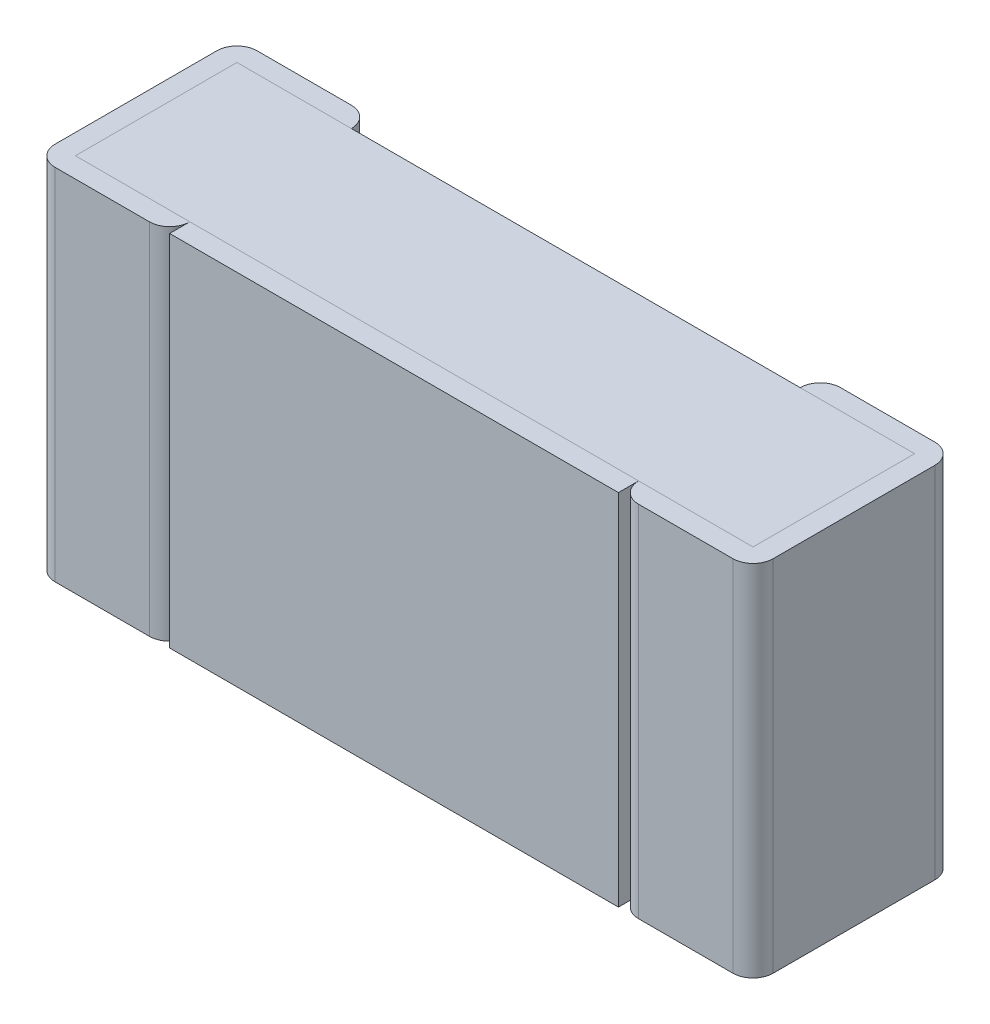
ISO-10303-21;
HEADER;
FILE_DESCRIPTION(('STEP AP214'),'2;1');
FILE_NAME('part.step','',(''),(''),'','','');
FILE_SCHEMA(('AUTOMOTIVE_DESIGN { 1 0 10303 214 1 1 1 1 }'));
ENDSEC;
DATA;
#1=APPLICATION_CONTEXT('core data for automotive mechanical design processes');
#2=APPLICATION_PROTOCOL_DEFINITION('international standard','automotive_design',2000,#1);
#3=PRODUCT_CONTEXT('',#1,'mechanical');
#4=PRODUCT('Part','Part','',(#3));
#5=PRODUCT_RELATED_PRODUCT_CATEGORY('part','',(#4));
#6=PRODUCT_DEFINITION_FORMATION('','',#4);
#7=PRODUCT_DEFINITION_CONTEXT('part definition',#1,'design');
#8=PRODUCT_DEFINITION('design','',#6,#7);
#9=PRODUCT_DEFINITION_SHAPE('','',#8);
#10=(LENGTH_UNIT() NAMED_UNIT(*) SI_UNIT(.MILLI.,.METRE.));
#11=(NAMED_UNIT(*) PLANE_ANGLE_UNIT() SI_UNIT($,.RADIAN.));
#12=(NAMED_UNIT(*) SI_UNIT($,.STERADIAN.) SOLID_ANGLE_UNIT());
#13=UNCERTAINTY_MEASURE_WITH_UNIT(LENGTH_MEASURE(1.E-05),#10,'distance_accuracy_value','');
#14=(GEOMETRIC_REPRESENTATION_CONTEXT(3) GLOBAL_UNCERTAINTY_ASSIGNED_CONTEXT((#13)) GLOBAL_UNIT_ASSIGNED_CONTEXT((#10,
#11,#12)) REPRESENTATION_CONTEXT('',''));
#15=CARTESIAN_POINT('',(0.,0.,0.));
#16=DIRECTION('',(0.,0.,1.));
#17=DIRECTION('',(1.,0.,0.));
#18=AXIS2_PLACEMENT_3D('',#15,#16,#17);
#19=CARTESIAN_POINT('',(146.314744279938,112.73404329235,112.661582908599));
#20=DIRECTION('',(0.,0.,1.));
#21=DIRECTION('',(1.,0.,0.));
#22=AXIS2_PLACEMENT_3D('',#19,#20,#21);
#23=PLANE('',#22);
#24=DIRECTION('',(0.,-1.,0.));
#25=VECTOR('',#24,1.);
#26=CARTESIAN_POINT('',(146.314744279938,112.73404329235,112.661582908599));
#27=LINE('',#26,#25);
#28=CARTESIAN_POINT('',(146.314744279938,112.73404329235,112.661582908599));
#29=VERTEX_POINT('',#28);
#30=CARTESIAN_POINT('',(146.314744279938,111.93404329235,112.661582908599));
#31=VERTEX_POINT('',#30);
#32=EDGE_CURVE('E67',#29,#31,#27,.T.);
#33=ORIENTED_EDGE('',*,*,#32,.F.);
#34=DIRECTION('',(-1.,0.,0.));
#35=VECTOR('',#34,1.);
#36=CARTESIAN_POINT('',(146.314744279938,112.73404329235,112.661582908599));
#37=LINE('',#36,#35);
#38=CARTESIAN_POINT('',(145.314744279938,112.73404329235,112.661582908599));
#39=VERTEX_POINT('',#38);
#40=EDGE_CURVE('E11',#29,#39,#37,.T.);
#41=ORIENTED_EDGE('',*,*,#40,.T.);
#42=DIRECTION('',(0.,-1.,0.));
#43=VECTOR('',#42,1.);
#44=CARTESIAN_POINT('',(145.314744279938,112.73404329235,112.661582908599));
#45=LINE('',#44,#43);
#46=CARTESIAN_POINT('',(145.314744279938,111.93404329235,112.661582908599));
#47=VERTEX_POINT('',#46);
#48=EDGE_CURVE('E55',#39,#47,#45,.T.);
#49=ORIENTED_EDGE('',*,*,#48,.T.);
#50=DIRECTION('',(-1.,0.,0.));
#51=VECTOR('',#50,1.);
#52=CARTESIAN_POINT('',(146.314744279938,111.93404329235,112.661582908599));
#53=LINE('',#52,#51);
#54=EDGE_CURVE('E325',#31,#47,#53,.T.);
#55=ORIENTED_EDGE('',*,*,#54,.F.);
#56=EDGE_LOOP('',(#33,#41,#49,#55));
#57=FACE_BOUND('',#56,.T.);
#58=ADVANCED_FACE('F44',(#57),#23,.T.);
#59=CARTESIAN_POINT('',(145.314744279938,112.73404329235,112.616582908599));
#60=DIRECTION('',(-1.,0.,0.));
#61=DIRECTION('',(0.,0.,1.));
#62=AXIS2_PLACEMENT_3D('',#59,#60,#61);
#63=PLANE('',#62);
#64=DIRECTION('',(0.,0.,1.));
#65=VECTOR('',#64,1.);
#66=CARTESIAN_POINT('',(145.314744279938,112.73404329235,112.616582908599));
#67=LINE('',#66,#65);
#68=CARTESIAN_POINT('',(145.314744279938,112.73404329235,112.616582908599));
#69=VERTEX_POINT('',#68);
#70=EDGE_CURVE('E338',#69,#39,#67,.T.);
#71=ORIENTED_EDGE('',*,*,#70,.F.);
#72=DIRECTION('',(0.,-1.,0.));
#73=VECTOR('',#72,1.);
#74=CARTESIAN_POINT('',(145.314744279938,112.73404329235,112.616582908599));
#75=LINE('',#74,#73);
#76=CARTESIAN_POINT('',(145.314744279938,111.93404329235,112.616582908599));
#77=VERTEX_POINT('',#76);
#78=EDGE_CURVE('E290',#69,#77,#75,.T.);
#79=ORIENTED_EDGE('',*,*,#78,.T.);
#80=DIRECTION('',(0.,0.,1.));
#81=VECTOR('',#80,1.);
#82=CARTESIAN_POINT('',(145.314744279938,111.93404329235,112.616582908599));
#83=LINE('',#82,#81);
#84=EDGE_CURVE('E294',#77,#47,#83,.T.);
#85=ORIENTED_EDGE('',*,*,#84,.T.);
#86=ORIENTED_EDGE('',*,*,#48,.F.);
#87=EDGE_LOOP('',(#71,#79,#85,#86));
#88=FACE_BOUND('',#87,.T.);
#89=ADVANCED_FACE('F565',(#88),#63,.T.);
#90=CARTESIAN_POINT('',(145.269744279938,112.73404329235,112.616582908599));
#91=DIRECTION('',(0.,-1.,0.));
#92=DIRECTION('',(1.,0.,0.));
#93=AXIS2_PLACEMENT_3D('',#90,#91,#92);
#94=CYLINDRICAL_SURFACE('',#93,0.0449999999999895);
#95=CARTESIAN_POINT('',(145.269744279938,112.73404329235,112.616582908599));
#96=DIRECTION('',(0.,-1.,0.));
#97=DIRECTION('',(0.,0.,1.));
#98=AXIS2_PLACEMENT_3D('',#95,#96,#97);
#99=CIRCLE('',#98,0.0450000000000034);
#100=CARTESIAN_POINT('',(145.269744279938,112.73404329235,112.661582908599));
#101=VERTEX_POINT('',#100);
#102=EDGE_CURVE('E272',#69,#101,#99,.T.);
#103=ORIENTED_EDGE('',*,*,#102,.T.);
#104=DIRECTION('',(0.,-1.,0.));
#105=VECTOR('',#104,1.);
#106=CARTESIAN_POINT('',(145.269744279938,112.73404329235,112.661582908599));
#107=LINE('',#106,#105);
#108=CARTESIAN_POINT('',(145.269744279938,111.93404329235,112.661582908599));
#109=VERTEX_POINT('',#108);
#110=EDGE_CURVE('E268',#101,#109,#107,.T.);
#111=ORIENTED_EDGE('',*,*,#110,.T.);
#112=CARTESIAN_POINT('',(145.269744279938,111.93404329235,112.616582908599));
#113=DIRECTION('',(0.,-1.,0.));
#114=DIRECTION('',(0.,0.,1.));
#115=AXIS2_PLACEMENT_3D('',#112,#113,#114);
#116=CIRCLE('',#115,0.0450000000000034);
#117=EDGE_CURVE('E365',#77,#109,#116,.T.);
#118=ORIENTED_EDGE('',*,*,#117,.F.);
#119=ORIENTED_EDGE('',*,*,#78,.F.);
#120=EDGE_LOOP('',(#103,#111,#118,#119));
#121=FACE_BOUND('',#120,.T.);
#122=ADVANCED_FACE('F490',(#121),#94,.T.);
#123=CARTESIAN_POINT('',(145.314744279938,112.73404329235,112.661582908599));
#124=DIRECTION('',(0.,0.,1.));
#125=DIRECTION('',(1.,0.,0.));
#126=AXIS2_PLACEMENT_3D('',#123,#124,#125);
#127=PLANE('',#126);
#128=DIRECTION('',(-1.,0.,0.));
#129=VECTOR('',#128,1.);
#130=CARTESIAN_POINT('',(145.314744279938,111.93404329235,112.661582908599));
#131=LINE('',#130,#129);
#132=CARTESIAN_POINT('',(145.059744279938,111.93404329235,112.661582908599));
#133=VERTEX_POINT('',#132);
#134=EDGE_CURVE('E410',#109,#133,#131,.T.);
#135=ORIENTED_EDGE('',*,*,#134,.F.);
#136=ORIENTED_EDGE('',*,*,#110,.F.);
#137=DIRECTION('',(-1.,0.,0.));
#138=VECTOR('',#137,1.);
#139=CARTESIAN_POINT('',(145.314744279938,112.73404329235,112.661582908599));
#140=LINE('',#139,#138);
#141=CARTESIAN_POINT('',(145.059744279938,112.73404329235,112.661582908599));
#142=VERTEX_POINT('',#141);
#143=EDGE_CURVE('E273',#101,#142,#140,.T.);
#144=ORIENTED_EDGE('',*,*,#143,.T.);
#145=DIRECTION('',(0.,-1.,0.));
#146=VECTOR('',#145,1.);
#147=CARTESIAN_POINT('',(145.059744279938,112.73404329235,112.661582908599));
#148=LINE('',#147,#146);
#149=EDGE_CURVE('E305',#142,#133,#148,.T.);
#150=ORIENTED_EDGE('',*,*,#149,.T.);
#151=EDGE_LOOP('',(#135,#136,#144,#150));
#152=FACE_BOUND('',#151,.T.);
#153=ADVANCED_FACE('F460',(#152),#127,.T.);
#154=CARTESIAN_POINT('',(145.059744279938,112.73404329235,112.616582908599));
#155=DIRECTION('',(0.,-1.,0.));
#156=DIRECTION('',(-1.,0.,0.));
#157=AXIS2_PLACEMENT_3D('',#154,#155,#156);
#158=CYLINDRICAL_SURFACE('',#157,0.0449999999999895);
#159=DIRECTION('',(0.,-1.,0.));
#160=VECTOR('',#159,1.);
#161=CARTESIAN_POINT('',(145.014744279938,112.73404329235,112.616582908599));
#162=LINE('',#161,#160);
#163=CARTESIAN_POINT('',(145.014744279938,112.73404329235,112.616582908599));
#164=VERTEX_POINT('',#163);
#165=CARTESIAN_POINT('',(145.014744279938,111.93404329235,112.616582908599));
#166=VERTEX_POINT('',#165);
#167=EDGE_CURVE('E228',#164,#166,#162,.T.);
#168=ORIENTED_EDGE('',*,*,#167,.T.);
#169=CARTESIAN_POINT('',(145.059744279938,111.93404329235,112.616582908599));
#170=DIRECTION('',(0.,1.,0.));
#171=DIRECTION('',(0.,0.,1.));
#172=AXIS2_PLACEMENT_3D('',#169,#170,#171);
#173=CIRCLE('',#172,0.0450000000000034);
#174=EDGE_CURVE('E243',#166,#133,#173,.T.);
#175=ORIENTED_EDGE('',*,*,#174,.T.);
#176=ORIENTED_EDGE('',*,*,#149,.F.);
#177=CARTESIAN_POINT('',(145.059744279938,112.73404329235,112.616582908599));
#178=DIRECTION('',(0.,1.,0.));
#179=DIRECTION('',(0.,0.,1.));
#180=AXIS2_PLACEMENT_3D('',#177,#178,#179);
#181=CIRCLE('',#180,0.0450000000000034);
#182=EDGE_CURVE('E233',#164,#142,#181,.T.);
#183=ORIENTED_EDGE('',*,*,#182,.F.);
#184=EDGE_LOOP('',(#168,#175,#176,#183));
#185=FACE_BOUND('',#184,.T.);
#186=ADVANCED_FACE('F463',(#185),#158,.T.);
#187=CARTESIAN_POINT('',(145.014744279938,112.73404329235,112.211582908599));
#188=DIRECTION('',(-1.,0.,0.));
#189=DIRECTION('',(0.,0.,1.));
#190=AXIS2_PLACEMENT_3D('',#187,#188,#189);
#191=PLANE('',#190);
#192=DIRECTION('',(0.,0.,1.));
#193=VECTOR('',#192,1.);
#194=CARTESIAN_POINT('',(145.014744279938,112.73404329235,112.211582908599));
#195=LINE('',#194,#193);
#196=CARTESIAN_POINT('',(145.014744279938,112.73404329235,112.256582908599));
#197=VERTEX_POINT('',#196);
#198=EDGE_CURVE('E221',#197,#164,#195,.T.);
#199=ORIENTED_EDGE('',*,*,#198,.F.);
#200=DIRECTION('',(0.,-1.,0.));
#201=VECTOR('',#200,1.);
#202=CARTESIAN_POINT('',(145.014744279938,112.73404329235,112.256582908599));
#203=LINE('',#202,#201);
#204=CARTESIAN_POINT('',(145.014744279938,111.93404329235,112.256582908599));
#205=VERTEX_POINT('',#204);
#206=EDGE_CURVE('E225',#197,#205,#203,.T.);
#207=ORIENTED_EDGE('',*,*,#206,.T.);
#208=DIRECTION('',(0.,0.,1.));
#209=VECTOR('',#208,1.);
#210=CARTESIAN_POINT('',(145.014744279938,111.93404329235,112.211582908599));
#211=LINE('',#210,#209);
#212=EDGE_CURVE('E244',#205,#166,#211,.T.);
#213=ORIENTED_EDGE('',*,*,#212,.T.);
#214=ORIENTED_EDGE('',*,*,#167,.F.);
#215=EDGE_LOOP('',(#199,#207,#213,#214));
#216=FACE_BOUND('',#215,.T.);
#217=ADVANCED_FACE('F223',(#216),#191,.T.);
#218=CARTESIAN_POINT('',(145.059744279938,112.73404329235,112.256582908599));
#219=DIRECTION('',(0.,-1.,0.));
#220=DIRECTION('',(-1.,0.,0.));
#221=AXIS2_PLACEMENT_3D('',#218,#219,#220);
#222=CYLINDRICAL_SURFACE('',#221,0.0449999999999895);
#223=CARTESIAN_POINT('',(145.059744279938,112.73404329235,112.256582908599));
#224=DIRECTION('',(0.,-1.,0.));
#225=DIRECTION('',(0.,0.,1.));
#226=AXIS2_PLACEMENT_3D('',#223,#224,#225);
#227=CIRCLE('',#226,0.0450000000000034);
#228=CARTESIAN_POINT('',(145.059744279938,112.73404329235,112.211582908599));
#229=VERTEX_POINT('',#228);
#230=EDGE_CURVE('E239',#197,#229,#227,.T.);
#231=ORIENTED_EDGE('',*,*,#230,.T.);
#232=DIRECTION('',(0.,-1.,0.));
#233=VECTOR('',#232,1.);
#234=CARTESIAN_POINT('',(145.059744279938,112.73404329235,112.211582908599));
#235=LINE('',#234,#233);
#236=CARTESIAN_POINT('',(145.059744279938,111.93404329235,112.211582908599));
#237=VERTEX_POINT('',#236);
#238=EDGE_CURVE('E250',#229,#237,#235,.T.);
#239=ORIENTED_EDGE('',*,*,#238,.T.);
#240=CARTESIAN_POINT('',(145.059744279938,111.93404329235,112.256582908599));
#241=DIRECTION('',(0.,-1.,0.));
#242=DIRECTION('',(0.,0.,1.));
#243=AXIS2_PLACEMENT_3D('',#240,#241,#242);
#244=CIRCLE('',#243,0.0450000000000034);
#245=EDGE_CURVE('E241',#205,#237,#244,.T.);
#246=ORIENTED_EDGE('',*,*,#245,.F.);
#247=ORIENTED_EDGE('',*,*,#206,.F.);
#248=EDGE_LOOP('',(#231,#239,#246,#247));
#249=FACE_BOUND('',#248,.T.);
#250=ADVANCED_FACE('F237',(#249),#222,.T.);
#251=CARTESIAN_POINT('',(145.314744279938,112.73404329235,112.211582908599));
#252=DIRECTION('',(0.,0.,1.));
#253=DIRECTION('',(1.,0.,0.));
#254=AXIS2_PLACEMENT_3D('',#251,#252,#253);
#255=PLANE('',#254);
#256=ORIENTED_EDGE('',*,*,#238,.F.);
#257=DIRECTION('',(-1.,0.,0.));
#258=VECTOR('',#257,1.);
#259=CARTESIAN_POINT('',(145.314744279938,112.73404329235,112.211582908599));
#260=LINE('',#259,#258);
#261=CARTESIAN_POINT('',(145.269744279938,112.73404329235,112.211582908599));
#262=VERTEX_POINT('',#261);
#263=EDGE_CURVE('E248',#262,#229,#260,.T.);
#264=ORIENTED_EDGE('',*,*,#263,.F.);
#265=DIRECTION('',(0.,-1.,0.));
#266=VECTOR('',#265,1.);
#267=CARTESIAN_POINT('',(145.269744279938,112.73404329235,112.211582908599));
#268=LINE('',#267,#266);
#269=CARTESIAN_POINT('',(145.269744279938,111.93404329235,112.211582908599));
#270=VERTEX_POINT('',#269);
#271=EDGE_CURVE('E258',#262,#270,#268,.T.);
#272=ORIENTED_EDGE('',*,*,#271,.T.);
#273=DIRECTION('',(-1.,0.,0.));
#274=VECTOR('',#273,1.);
#275=CARTESIAN_POINT('',(145.314744279938,111.93404329235,112.211582908599));
#276=LINE('',#275,#274);
#277=EDGE_CURVE('E350',#270,#237,#276,.T.);
#278=ORIENTED_EDGE('',*,*,#277,.T.);
#279=EDGE_LOOP('',(#256,#264,#272,#278));
#280=FACE_BOUND('',#279,.T.);
#281=ADVANCED_FACE('F645',(#280),#255,.F.);
#282=CARTESIAN_POINT('',(145.269744279938,112.73404329235,112.256582908599));
#283=DIRECTION('',(0.,-1.,0.));
#284=DIRECTION('',(1.,0.,0.));
#285=AXIS2_PLACEMENT_3D('',#282,#283,#284);
#286=CYLINDRICAL_SURFACE('',#285,0.0449999999999895);
#287=DIRECTION('',(0.,-1.,0.));
#288=VECTOR('',#287,1.);
#289=CARTESIAN_POINT('',(145.314744279938,112.73404329235,112.256582908599));
#290=LINE('',#289,#288);
#291=CARTESIAN_POINT('',(145.314744279938,112.73404329235,112.256582908599));
#292=VERTEX_POINT('',#291);
#293=CARTESIAN_POINT('',(145.314744279938,111.93404329235,112.256582908599));
#294=VERTEX_POINT('',#293);
#295=EDGE_CURVE('E359',#292,#294,#290,.T.);
#296=ORIENTED_EDGE('',*,*,#295,.T.);
#297=CARTESIAN_POINT('',(145.269744279938,111.93404329235,112.256582908599));
#298=DIRECTION('',(0.,1.,0.));
#299=DIRECTION('',(0.,0.,1.));
#300=AXIS2_PLACEMENT_3D('',#297,#298,#299);
#301=CIRCLE('',#300,0.0450000000000034);
#302=EDGE_CURVE('E324',#294,#270,#301,.T.);
#303=ORIENTED_EDGE('',*,*,#302,.T.);
#304=ORIENTED_EDGE('',*,*,#271,.F.);
#305=CARTESIAN_POINT('',(145.269744279938,112.73404329235,112.256582908599));
#306=DIRECTION('',(0.,1.,0.));
#307=DIRECTION('',(0.,0.,1.));
#308=AXIS2_PLACEMENT_3D('',#305,#306,#307);
#309=CIRCLE('',#308,0.0450000000000034);
#310=EDGE_CURVE('E274',#292,#262,#309,.T.);
#311=ORIENTED_EDGE('',*,*,#310,.F.);
#312=EDGE_LOOP('',(#296,#303,#304,#311));
#313=FACE_BOUND('',#312,.T.);
#314=ADVANCED_FACE('F498',(#313),#286,.T.);
#315=CARTESIAN_POINT('',(146.314744279938,111.93404329235,112.616582908599));
#316=DIRECTION('',(0.,-1.,0.));
#317=DIRECTION('',(0.,0.,-1.));
#318=AXIS2_PLACEMENT_3D('',#315,#316,#317);
#319=PLANE('',#318);
#320=DIRECTION('',(-1.,0.,0.));
#321=VECTOR('',#320,1.);
#322=CARTESIAN_POINT('',(146.314744279938,111.93404329235,112.616582908599));
#323=LINE('',#322,#321);
#324=CARTESIAN_POINT('',(146.314744279938,111.93404329235,112.616582908599));
#325=VERTEX_POINT('',#324);
#326=EDGE_CURVE('E336',#325,#77,#323,.T.);
#327=ORIENTED_EDGE('',*,*,#326,.F.);
#328=DIRECTION('',(0.,0.,1.));
#329=VECTOR('',#328,1.);
#330=CARTESIAN_POINT('',(146.314744279938,111.93404329235,112.616582908599));
#331=LINE('',#330,#329);
#332=EDGE_CURVE('E320',#325,#31,#331,.T.);
#333=ORIENTED_EDGE('',*,*,#332,.T.);
#334=ORIENTED_EDGE('',*,*,#54,.T.);
#335=ORIENTED_EDGE('',*,*,#84,.F.);
#336=EDGE_LOOP('',(#327,#333,#334,#335));
#337=FACE_BOUND('',#336,.T.);
#338=ADVANCED_FACE('F562',(#337),#319,.T.);
#339=CARTESIAN_POINT('',(145.314744279938,111.93404329235,112.211582908599));
#340=DIRECTION('',(0.,-1.,0.));
#341=DIRECTION('',(0.,0.,-1.));
#342=AXIS2_PLACEMENT_3D('',#339,#340,#341);
#343=PLANE('',#342);
#344=ORIENTED_EDGE('',*,*,#277,.F.);
#345=ORIENTED_EDGE('',*,*,#302,.F.);
#346=DIRECTION('',(-1.,0.,0.));
#347=VECTOR('',#346,1.);
#348=CARTESIAN_POINT('',(146.569744279938,111.93404329235,112.256582908599));
#349=LINE('',#348,#347);
#350=CARTESIAN_POINT('',(145.059744279938,111.93404329235,112.256582908599));
#351=VERTEX_POINT('',#350);
#352=EDGE_CURVE('E364',#294,#351,#349,.T.);
#353=ORIENTED_EDGE('',*,*,#352,.T.);
#354=DIRECTION('',(0.,0.,1.));
#355=VECTOR('',#354,1.);
#356=CARTESIAN_POINT('',(145.059744279938,111.93404329235,112.256582908599));
#357=LINE('',#356,#355);
#358=CARTESIAN_POINT('',(145.059744279938,111.93404329235,112.616582908599));
#359=VERTEX_POINT('',#358);
#360=EDGE_CURVE('E360',#351,#359,#357,.T.);
#361=ORIENTED_EDGE('',*,*,#360,.T.);
#362=DIRECTION('',(-1.,0.,0.));
#363=VECTOR('',#362,1.);
#364=CARTESIAN_POINT('',(146.569744279938,111.93404329235,112.616582908599));
#365=LINE('',#364,#363);
#366=EDGE_CURVE('E332',#77,#359,#365,.T.);
#367=ORIENTED_EDGE('',*,*,#366,.F.);
#368=ORIENTED_EDGE('',*,*,#117,.T.);
#369=ORIENTED_EDGE('',*,*,#134,.T.);
#370=ORIENTED_EDGE('',*,*,#174,.F.);
#371=ORIENTED_EDGE('',*,*,#212,.F.);
#372=ORIENTED_EDGE('',*,*,#245,.T.);
#373=EDGE_LOOP('',(#344,#345,#353,#361,#367,#368,#369,#370,#371,#372));
#374=FACE_BOUND('',#373,.T.);
#375=ADVANCED_FACE('F466',(#374),#343,.T.);
#376=CARTESIAN_POINT('',(146.314744279938,112.73404329235,112.616582908599));
#377=DIRECTION('',(-1.,0.,0.));
#378=DIRECTION('',(0.,0.,1.));
#379=AXIS2_PLACEMENT_3D('',#376,#377,#378);
#380=PLANE('',#379);
#381=ORIENTED_EDGE('',*,*,#32,.T.);
#382=ORIENTED_EDGE('',*,*,#332,.F.);
#383=DIRECTION('',(0.,-1.,0.));
#384=VECTOR('',#383,1.);
#385=CARTESIAN_POINT('',(146.314744279938,112.73404329235,112.616582908599));
#386=LINE('',#385,#384);
#387=CARTESIAN_POINT('',(146.314744279938,112.73404329235,112.616582908599));
#388=VERTEX_POINT('',#387);
#389=EDGE_CURVE('E337',#388,#325,#386,.T.);
#390=ORIENTED_EDGE('',*,*,#389,.F.);
#391=DIRECTION('',(0.,0.,1.));
#392=VECTOR('',#391,1.);
#393=CARTESIAN_POINT('',(146.314744279938,112.73404329235,112.616582908599));
#394=LINE('',#393,#392);
#395=EDGE_CURVE('E280',#388,#29,#394,.T.);
#396=ORIENTED_EDGE('',*,*,#395,.T.);
#397=EDGE_LOOP('',(#381,#382,#390,#396));
#398=FACE_BOUND('',#397,.T.);
#399=ADVANCED_FACE('F560',(#398),#380,.F.);
#400=CARTESIAN_POINT('',(146.314744279938,112.73404329235,112.616582908599));
#401=DIRECTION('',(0.,-1.,0.));
#402=DIRECTION('',(0.,0.,-1.));
#403=AXIS2_PLACEMENT_3D('',#400,#401,#402);
#404=PLANE('',#403);
#405=ORIENTED_EDGE('',*,*,#70,.T.);
#406=ORIENTED_EDGE('',*,*,#40,.F.);
#407=ORIENTED_EDGE('',*,*,#395,.F.);
#408=DIRECTION('',(-1.,0.,0.));
#409=VECTOR('',#408,1.);
#410=CARTESIAN_POINT('',(146.314744279938,112.73404329235,112.616582908599));
#411=LINE('',#410,#409);
#412=EDGE_CURVE('E232',#388,#69,#411,.T.);
#413=ORIENTED_EDGE('',*,*,#412,.T.);
#414=EDGE_LOOP('',(#405,#406,#407,#413));
#415=FACE_BOUND('',#414,.T.);
#416=ADVANCED_FACE('F567',(#415),#404,.F.);
#417=CARTESIAN_POINT('',(145.314744279938,112.73404329235,112.211582908599));
#418=DIRECTION('',(0.,-1.,0.));
#419=DIRECTION('',(0.,0.,-1.));
#420=AXIS2_PLACEMENT_3D('',#417,#418,#419);
#421=PLANE('',#420);
#422=ORIENTED_EDGE('',*,*,#230,.F.);
#423=ORIENTED_EDGE('',*,*,#198,.T.);
#424=ORIENTED_EDGE('',*,*,#182,.T.);
#425=ORIENTED_EDGE('',*,*,#143,.F.);
#426=ORIENTED_EDGE('',*,*,#102,.F.);
#427=DIRECTION('',(-1.,0.,0.));
#428=VECTOR('',#427,1.);
#429=CARTESIAN_POINT('',(146.569744279938,112.73404329235,112.616582908599));
#430=LINE('',#429,#428);
#431=CARTESIAN_POINT('',(145.059744279938,112.73404329235,112.616582908599));
#432=VERTEX_POINT('',#431);
#433=EDGE_CURVE('E277',#69,#432,#430,.T.);
#434=ORIENTED_EDGE('',*,*,#433,.T.);
#435=DIRECTION('',(0.,0.,1.));
#436=VECTOR('',#435,1.);
#437=CARTESIAN_POINT('',(145.059744279938,112.73404329235,112.256582908599));
#438=LINE('',#437,#436);
#439=CARTESIAN_POINT('',(145.059744279938,112.73404329235,112.256582908599));
#440=VERTEX_POINT('',#439);
#441=EDGE_CURVE('E121',#440,#432,#438,.T.);
#442=ORIENTED_EDGE('',*,*,#441,.F.);
#443=DIRECTION('',(-1.,0.,0.));
#444=VECTOR('',#443,1.);
#445=CARTESIAN_POINT('',(146.569744279938,112.73404329235,112.256582908599));
#446=LINE('',#445,#444);
#447=EDGE_CURVE('E281',#292,#440,#446,.T.);
#448=ORIENTED_EDGE('',*,*,#447,.F.);
#449=ORIENTED_EDGE('',*,*,#310,.T.);
#450=ORIENTED_EDGE('',*,*,#263,.T.);
#451=EDGE_LOOP('',(#422,#423,#424,#425,#426,#434,#442,#448,#449,#450));
#452=FACE_BOUND('',#451,.T.);
#453=ADVANCED_FACE('F246',(#452),#421,.F.);
#454=CARTESIAN_POINT('',(146.569744279938,112.73404329235,112.256582908599));
#455=DIRECTION('',(0.,0.,1.));
#456=DIRECTION('',(1.,0.,0.));
#457=AXIS2_PLACEMENT_3D('',#454,#455,#456);
#458=PLANE('',#457);
#459=DIRECTION('',(-1.,0.,0.));
#460=VECTOR('',#459,1.);
#461=CARTESIAN_POINT('',(146.569744279938,111.93404329235,112.256582908599));
#462=LINE('',#461,#460);
#463=CARTESIAN_POINT('',(146.314744279938,111.93404329235,112.256582908599));
#464=VERTEX_POINT('',#463);
#465=EDGE_CURVE('E369',#464,#294,#462,.T.);
#466=ORIENTED_EDGE('',*,*,#465,.T.);
#467=ORIENTED_EDGE('',*,*,#295,.F.);
#468=DIRECTION('',(-1.,0.,0.));
#469=VECTOR('',#468,1.);
#470=CARTESIAN_POINT('',(146.569744279938,112.73404329235,112.256582908599));
#471=LINE('',#470,#469);
#472=CARTESIAN_POINT('',(146.314744279938,112.73404329235,112.256582908599));
#473=VERTEX_POINT('',#472);
#474=EDGE_CURVE('E267',#473,#292,#471,.T.);
#475=ORIENTED_EDGE('',*,*,#474,.F.);
#476=DIRECTION('',(0.,-1.,0.));
#477=VECTOR('',#476,1.);
#478=CARTESIAN_POINT('',(146.314744279938,112.73404329235,112.256582908599));
#479=LINE('',#478,#477);
#480=EDGE_CURVE('E373',#473,#464,#479,.T.);
#481=ORIENTED_EDGE('',*,*,#480,.T.);
#482=EDGE_LOOP('',(#466,#467,#475,#481));
#483=FACE_BOUND('',#482,.T.);
#484=ADVANCED_FACE('F500',(#483),#458,.F.);
#485=CARTESIAN_POINT('',(146.569744279938,111.93404329235,112.256582908599));
#486=DIRECTION('',(0.,-1.,0.));
#487=DIRECTION('',(0.,0.,-1.));
#488=AXIS2_PLACEMENT_3D('',#485,#486,#487);
#489=PLANE('',#488);
#490=DIRECTION('',(-1.,0.,0.));
#491=VECTOR('',#490,1.);
#492=CARTESIAN_POINT('',(146.569744279938,111.93404329235,112.256582908599));
#493=LINE('',#492,#491);
#494=CARTESIAN_POINT('',(146.569744279938,111.93404329235,112.256582908599));
#495=VERTEX_POINT('',#494);
#496=EDGE_CURVE('E262',#495,#464,#493,.T.);
#497=ORIENTED_EDGE('',*,*,#496,.F.);
#498=DIRECTION('',(0.,0.,1.));
#499=VECTOR('',#498,1.);
#500=CARTESIAN_POINT('',(146.569744279938,111.93404329235,112.256582908599));
#501=LINE('',#500,#499);
#502=CARTESIAN_POINT('',(146.569744279938,111.93404329235,112.616582908599));
#503=VERTEX_POINT('',#502);
#504=EDGE_CURVE('E388',#495,#503,#501,.T.);
#505=ORIENTED_EDGE('',*,*,#504,.T.);
#506=DIRECTION('',(-1.,0.,0.));
#507=VECTOR('',#506,1.);
#508=CARTESIAN_POINT('',(146.569744279938,111.93404329235,112.616582908599));
#509=LINE('',#508,#507);
#510=EDGE_CURVE('E428',#503,#325,#509,.T.);
#511=ORIENTED_EDGE('',*,*,#510,.T.);
#512=ORIENTED_EDGE('',*,*,#326,.T.);
#513=ORIENTED_EDGE('',*,*,#366,.T.);
#514=ORIENTED_EDGE('',*,*,#360,.F.);
#515=ORIENTED_EDGE('',*,*,#352,.F.);
#516=ORIENTED_EDGE('',*,*,#465,.F.);
#517=EDGE_LOOP('',(#497,#505,#511,#512,#513,#514,#515,#516));
#518=FACE_BOUND('',#517,.T.);
#519=ADVANCED_FACE('F506',(#518),#489,.T.);
#520=CARTESIAN_POINT('',(146.359744279938,112.73404329235,112.616582908599));
#521=DIRECTION('',(0.,-1.,0.));
#522=DIRECTION('',(-1.,0.,0.));
#523=AXIS2_PLACEMENT_3D('',#520,#521,#522);
#524=CYLINDRICAL_SURFACE('',#523,0.0449999999999895);
#525=ORIENTED_EDGE('',*,*,#389,.T.);
#526=CARTESIAN_POINT('',(146.359744279938,111.93404329235,112.616582908599));
#527=DIRECTION('',(0.,1.,0.));
#528=DIRECTION('',(0.,0.,1.));
#529=AXIS2_PLACEMENT_3D('',#526,#527,#528);
#530=CIRCLE('',#529,0.0450000000000034);
#531=CARTESIAN_POINT('',(146.359744279938,111.93404329235,112.661582908599));
#532=VERTEX_POINT('',#531);
#533=EDGE_CURVE('E298',#325,#532,#530,.T.);
#534=ORIENTED_EDGE('',*,*,#533,.T.);
#535=DIRECTION('',(0.,-1.,0.));
#536=VECTOR('',#535,1.);
#537=CARTESIAN_POINT('',(146.359744279938,112.73404329235,112.661582908599));
#538=LINE('',#537,#536);
#539=CARTESIAN_POINT('',(146.359744279938,112.73404329235,112.661582908599));
#540=VERTEX_POINT('',#539);
#541=EDGE_CURVE('E264',#540,#532,#538,.T.);
#542=ORIENTED_EDGE('',*,*,#541,.F.);
#543=CARTESIAN_POINT('',(146.359744279938,112.73404329235,112.616582908599));
#544=DIRECTION('',(0.,1.,0.));
#545=DIRECTION('',(0.,0.,1.));
#546=AXIS2_PLACEMENT_3D('',#543,#544,#545);
#547=CIRCLE('',#546,0.0450000000000034);
#548=EDGE_CURVE('E378',#388,#540,#547,.T.);
#549=ORIENTED_EDGE('',*,*,#548,.F.);
#550=EDGE_LOOP('',(#525,#534,#542,#549));
#551=FACE_BOUND('',#550,.T.);
#552=ADVANCED_FACE('F555',(#551),#524,.T.);
#553=CARTESIAN_POINT('',(146.614744279938,112.73404329235,112.661582908599));
#554=DIRECTION('',(0.,0.,1.));
#555=DIRECTION('',(1.,0.,0.));
#556=AXIS2_PLACEMENT_3D('',#553,#554,#555);
#557=PLANE('',#556);
#558=DIRECTION('',(-1.,0.,0.));
#559=VECTOR('',#558,1.);
#560=CARTESIAN_POINT('',(146.614744279938,111.93404329235,112.661582908599));
#561=LINE('',#560,#559);
#562=CARTESIAN_POINT('',(146.569744279938,111.93404329235,112.661582908599));
#563=VERTEX_POINT('',#562);
#564=EDGE_CURVE('E289',#563,#532,#561,.T.);
#565=ORIENTED_EDGE('',*,*,#564,.F.);
#566=DIRECTION('',(0.,-1.,0.));
#567=VECTOR('',#566,1.);
#568=CARTESIAN_POINT('',(146.569744279938,112.73404329235,112.661582908599));
#569=LINE('',#568,#567);
#570=CARTESIAN_POINT('',(146.569744279938,112.73404329235,112.661582908599));
#571=VERTEX_POINT('',#570);
#572=EDGE_CURVE('E396',#571,#563,#569,.T.);
#573=ORIENTED_EDGE('',*,*,#572,.F.);
#574=DIRECTION('',(-1.,0.,0.));
#575=VECTOR('',#574,1.);
#576=CARTESIAN_POINT('',(146.614744279938,112.73404329235,112.661582908599));
#577=LINE('',#576,#575);
#578=EDGE_CURVE('E266',#571,#540,#577,.T.);
#579=ORIENTED_EDGE('',*,*,#578,.T.);
#580=ORIENTED_EDGE('',*,*,#541,.T.);
#581=EDGE_LOOP('',(#565,#573,#579,#580));
#582=FACE_BOUND('',#581,.T.);
#583=ADVANCED_FACE('F541',(#582),#557,.T.);
#584=CARTESIAN_POINT('',(146.569744279938,112.73404329235,112.256582908599));
#585=DIRECTION('',(0.,-1.,0.));
#586=DIRECTION('',(0.,0.,-1.));
#587=AXIS2_PLACEMENT_3D('',#584,#585,#586);
#588=PLANE('',#587);
#589=ORIENTED_EDGE('',*,*,#474,.T.);
#590=ORIENTED_EDGE('',*,*,#447,.T.);
#591=ORIENTED_EDGE('',*,*,#441,.T.);
#592=ORIENTED_EDGE('',*,*,#433,.F.);
#593=ORIENTED_EDGE('',*,*,#412,.F.);
#594=DIRECTION('',(-1.,0.,0.));
#595=VECTOR('',#594,1.);
#596=CARTESIAN_POINT('',(146.569744279938,112.73404329235,112.616582908599));
#597=LINE('',#596,#595);
#598=CARTESIAN_POINT('',(146.569744279938,112.73404329235,112.616582908599));
#599=VERTEX_POINT('',#598);
#600=EDGE_CURVE('E408',#599,#388,#597,.T.);
#601=ORIENTED_EDGE('',*,*,#600,.F.);
#602=DIRECTION('',(0.,0.,1.));
#603=VECTOR('',#602,1.);
#604=CARTESIAN_POINT('',(146.569744279938,112.73404329235,112.256582908599));
#605=LINE('',#604,#603);
#606=CARTESIAN_POINT('',(146.569744279938,112.73404329235,112.256582908599));
#607=VERTEX_POINT('',#606);
#608=EDGE_CURVE('E404',#607,#599,#605,.T.);
#609=ORIENTED_EDGE('',*,*,#608,.F.);
#610=DIRECTION('',(-1.,0.,0.));
#611=VECTOR('',#610,1.);
#612=CARTESIAN_POINT('',(146.569744279938,112.73404329235,112.256582908599));
#613=LINE('',#612,#611);
#614=EDGE_CURVE('E134',#607,#473,#613,.T.);
#615=ORIENTED_EDGE('',*,*,#614,.T.);
#616=EDGE_LOOP('',(#589,#590,#591,#592,#593,#601,#609,#615));
#617=FACE_BOUND('',#616,.T.);
#618=ADVANCED_FACE('F493',(#617),#588,.F.);
#619=CARTESIAN_POINT('',(146.359744279938,112.73404329235,112.256582908599));
#620=DIRECTION('',(0.,-1.,0.));
#621=DIRECTION('',(-1.,0.,0.));
#622=AXIS2_PLACEMENT_3D('',#619,#620,#621);
#623=CYLINDRICAL_SURFACE('',#622,0.0449999999999895);
#624=CARTESIAN_POINT('',(146.359744279938,112.73404329235,112.256582908599));
#625=DIRECTION('',(0.,-1.,0.));
#626=DIRECTION('',(0.,0.,1.));
#627=AXIS2_PLACEMENT_3D('',#624,#625,#626);
#628=CIRCLE('',#627,0.0450000000000034);
#629=CARTESIAN_POINT('',(146.359744279938,112.73404329235,112.211582908599));
#630=VERTEX_POINT('',#629);
#631=EDGE_CURVE('E345',#473,#630,#628,.T.);
#632=ORIENTED_EDGE('',*,*,#631,.T.);
#633=DIRECTION('',(0.,-1.,0.));
#634=VECTOR('',#633,1.);
#635=CARTESIAN_POINT('',(146.359744279938,112.73404329235,112.211582908599));
#636=LINE('',#635,#634);
#637=CARTESIAN_POINT('',(146.359744279938,111.93404329235,112.211582908599));
#638=VERTEX_POINT('',#637);
#639=EDGE_CURVE('E303',#630,#638,#636,.T.);
#640=ORIENTED_EDGE('',*,*,#639,.T.);
#641=CARTESIAN_POINT('',(146.359744279938,111.93404329235,112.256582908599));
#642=DIRECTION('',(0.,-1.,0.));
#643=DIRECTION('',(0.,0.,1.));
#644=AXIS2_PLACEMENT_3D('',#641,#642,#643);
#645=CIRCLE('',#644,0.0450000000000034);
#646=EDGE_CURVE('E395',#464,#638,#645,.T.);
#647=ORIENTED_EDGE('',*,*,#646,.F.);
#648=ORIENTED_EDGE('',*,*,#480,.F.);
#649=EDGE_LOOP('',(#632,#640,#647,#648));
#650=FACE_BOUND('',#649,.T.);
#651=ADVANCED_FACE('F514',(#650),#623,.T.);
#652=CARTESIAN_POINT('',(146.614744279938,112.73404329235,112.211582908599));
#653=DIRECTION('',(0.,0.,1.));
#654=DIRECTION('',(1.,0.,0.));
#655=AXIS2_PLACEMENT_3D('',#652,#653,#654);
#656=PLANE('',#655);
#657=ORIENTED_EDGE('',*,*,#639,.F.);
#658=DIRECTION('',(-1.,0.,0.));
#659=VECTOR('',#658,1.);
#660=CARTESIAN_POINT('',(146.614744279938,112.73404329235,112.211582908599));
#661=LINE('',#660,#659);
#662=CARTESIAN_POINT('',(146.569744279938,112.73404329235,112.211582908599));
#663=VERTEX_POINT('',#662);
#664=EDGE_CURVE('E48',#663,#630,#661,.T.);
#665=ORIENTED_EDGE('',*,*,#664,.F.);
#666=DIRECTION('',(0.,-1.,0.));
#667=VECTOR('',#666,1.);
#668=CARTESIAN_POINT('',(146.569744279938,112.73404329235,112.211582908599));
#669=LINE('',#668,#667);
#670=CARTESIAN_POINT('',(146.569744279938,111.93404329235,112.211582908599));
#671=VERTEX_POINT('',#670);
#672=EDGE_CURVE('E299',#663,#671,#669,.T.);
#673=ORIENTED_EDGE('',*,*,#672,.T.);
#674=DIRECTION('',(-1.,0.,0.));
#675=VECTOR('',#674,1.);
#676=CARTESIAN_POINT('',(146.614744279938,111.93404329235,112.211582908599));
#677=LINE('',#676,#675);
#678=EDGE_CURVE('E304',#671,#638,#677,.T.);
#679=ORIENTED_EDGE('',*,*,#678,.T.);
#680=EDGE_LOOP('',(#657,#665,#673,#679));
#681=FACE_BOUND('',#680,.T.);
#682=ADVANCED_FACE('F745',(#681),#656,.F.);
#683=CARTESIAN_POINT('',(146.614744279938,111.93404329235,112.211582908599));
#684=DIRECTION('',(0.,-1.,0.));
#685=DIRECTION('',(0.,0.,-1.));
#686=AXIS2_PLACEMENT_3D('',#683,#684,#685);
#687=PLANE('',#686);
#688=ORIENTED_EDGE('',*,*,#678,.F.);
#689=CARTESIAN_POINT('',(146.569744279938,111.93404329235,112.256582908599));
#690=DIRECTION('',(0.,1.,0.));
#691=DIRECTION('',(0.,0.,1.));
#692=AXIS2_PLACEMENT_3D('',#689,#690,#691);
#693=CIRCLE('',#692,0.0450000000000034);
#694=CARTESIAN_POINT('',(146.614744279938,111.93404329235,112.256582908599));
#695=VERTEX_POINT('',#694);
#696=EDGE_CURVE('E407',#695,#671,#693,.T.);
#697=ORIENTED_EDGE('',*,*,#696,.F.);
#698=DIRECTION('',(0.,0.,1.));
#699=VECTOR('',#698,1.);
#700=CARTESIAN_POINT('',(146.614744279938,111.93404329235,112.211582908599));
#701=LINE('',#700,#699);
#702=CARTESIAN_POINT('',(146.614744279938,111.93404329235,112.616582908599));
#703=VERTEX_POINT('',#702);
#704=EDGE_CURVE('E288',#695,#703,#701,.T.);
#705=ORIENTED_EDGE('',*,*,#704,.T.);
#706=CARTESIAN_POINT('',(146.569744279938,111.93404329235,112.616582908599));
#707=DIRECTION('',(0.,-1.,0.));
#708=DIRECTION('',(0.,0.,1.));
#709=AXIS2_PLACEMENT_3D('',#706,#707,#708);
#710=CIRCLE('',#709,0.0450000000000034);
#711=EDGE_CURVE('E284',#703,#563,#710,.T.);
#712=ORIENTED_EDGE('',*,*,#711,.T.);
#713=ORIENTED_EDGE('',*,*,#564,.T.);
#714=ORIENTED_EDGE('',*,*,#533,.F.);
#715=ORIENTED_EDGE('',*,*,#510,.F.);
#716=ORIENTED_EDGE('',*,*,#504,.F.);
#717=ORIENTED_EDGE('',*,*,#496,.T.);
#718=ORIENTED_EDGE('',*,*,#646,.T.);
#719=EDGE_LOOP('',(#688,#697,#705,#712,#713,#714,#715,#716,#717,#718));
#720=FACE_BOUND('',#719,.T.);
#721=ADVANCED_FACE('F544',(#720),#687,.T.);
#722=CARTESIAN_POINT('',(146.569744279938,112.73404329235,112.616582908599));
#723=DIRECTION('',(0.,-1.,0.));
#724=DIRECTION('',(1.,0.,0.));
#725=AXIS2_PLACEMENT_3D('',#722,#723,#724);
#726=CYLINDRICAL_SURFACE('',#725,0.0449999999999895);
#727=CARTESIAN_POINT('',(146.569744279938,112.73404329235,112.616582908599));
#728=DIRECTION('',(0.,-1.,0.));
#729=DIRECTION('',(0.,0.,1.));
#730=AXIS2_PLACEMENT_3D('',#727,#728,#729);
#731=CIRCLE('',#730,0.0450000000000034);
#732=CARTESIAN_POINT('',(146.614744279938,112.73404329235,112.616582908599));
#733=VERTEX_POINT('',#732);
#734=EDGE_CURVE('E391',#733,#571,#731,.T.);
#735=ORIENTED_EDGE('',*,*,#734,.T.);
#736=ORIENTED_EDGE('',*,*,#572,.T.);
#737=ORIENTED_EDGE('',*,*,#711,.F.);
#738=DIRECTION('',(0.,-1.,0.));
#739=VECTOR('',#738,1.);
#740=CARTESIAN_POINT('',(146.614744279938,112.73404329235,112.616582908599));
#741=LINE('',#740,#739);
#742=EDGE_CURVE('E312',#733,#703,#741,.T.);
#743=ORIENTED_EDGE('',*,*,#742,.F.);
#744=EDGE_LOOP('',(#735,#736,#737,#743));
#745=FACE_BOUND('',#744,.T.);
#746=ADVANCED_FACE('F46',(#745),#726,.T.);
#747=CARTESIAN_POINT('',(146.569744279938,112.73404329235,112.256582908599));
#748=DIRECTION('',(0.,-1.,0.));
#749=DIRECTION('',(1.,0.,0.));
#750=AXIS2_PLACEMENT_3D('',#747,#748,#749);
#751=CYLINDRICAL_SURFACE('',#750,0.0449999999999895);
#752=DIRECTION('',(0.,-1.,0.));
#753=VECTOR('',#752,1.);
#754=CARTESIAN_POINT('',(146.614744279938,112.73404329235,112.256582908599));
#755=LINE('',#754,#753);
#756=CARTESIAN_POINT('',(146.614744279938,112.73404329235,112.256582908599));
#757=VERTEX_POINT('',#756);
#758=EDGE_CURVE('E433',#757,#695,#755,.T.);
#759=ORIENTED_EDGE('',*,*,#758,.T.);
#760=ORIENTED_EDGE('',*,*,#696,.T.);
#761=ORIENTED_EDGE('',*,*,#672,.F.);
#762=CARTESIAN_POINT('',(146.569744279938,112.73404329235,112.256582908599));
#763=DIRECTION('',(0.,1.,0.));
#764=DIRECTION('',(0.,0.,1.));
#765=AXIS2_PLACEMENT_3D('',#762,#763,#764);
#766=CIRCLE('',#765,0.0450000000000034);
#767=EDGE_CURVE('E374',#757,#663,#766,.T.);
#768=ORIENTED_EDGE('',*,*,#767,.F.);
#769=EDGE_LOOP('',(#759,#760,#761,#768));
#770=FACE_BOUND('',#769,.T.);
#771=ADVANCED_FACE('F653',(#770),#751,.T.);
#772=CARTESIAN_POINT('',(146.614744279938,112.73404329235,112.211582908599));
#773=DIRECTION('',(0.,-1.,0.));
#774=DIRECTION('',(0.,0.,-1.));
#775=AXIS2_PLACEMENT_3D('',#772,#773,#774);
#776=PLANE('',#775);
#777=ORIENTED_EDGE('',*,*,#631,.F.);
#778=ORIENTED_EDGE('',*,*,#614,.F.);
#779=ORIENTED_EDGE('',*,*,#608,.T.);
#780=ORIENTED_EDGE('',*,*,#600,.T.);
#781=ORIENTED_EDGE('',*,*,#548,.T.);
#782=ORIENTED_EDGE('',*,*,#578,.F.);
#783=ORIENTED_EDGE('',*,*,#734,.F.);
#784=DIRECTION('',(0.,0.,1.));
#785=VECTOR('',#784,1.);
#786=CARTESIAN_POINT('',(146.614744279938,112.73404329235,112.211582908599));
#787=LINE('',#786,#785);
#788=EDGE_CURVE('E316',#757,#733,#787,.T.);
#789=ORIENTED_EDGE('',*,*,#788,.F.);
#790=ORIENTED_EDGE('',*,*,#767,.T.);
#791=ORIENTED_EDGE('',*,*,#664,.T.);
#792=EDGE_LOOP('',(#777,#778,#779,#780,#781,#782,#783,#789,#790,#791));
#793=FACE_BOUND('',#792,.T.);
#794=ADVANCED_FACE('F552',(#793),#776,.F.);
#795=CARTESIAN_POINT('',(146.614744279938,112.73404329235,112.211582908599));
#796=DIRECTION('',(-1.,0.,0.));
#797=DIRECTION('',(0.,0.,1.));
#798=AXIS2_PLACEMENT_3D('',#795,#796,#797);
#799=PLANE('',#798);
#800=ORIENTED_EDGE('',*,*,#742,.T.);
#801=ORIENTED_EDGE('',*,*,#704,.F.);
#802=ORIENTED_EDGE('',*,*,#758,.F.);
#803=ORIENTED_EDGE('',*,*,#788,.T.);
#804=EDGE_LOOP('',(#800,#801,#802,#803));
#805=FACE_BOUND('',#804,.T.);
#806=ADVANCED_FACE('F548',(#805),#799,.F.);
#807=CLOSED_SHELL('',(#58,#89,#122,#153,#186,#217,#250,#281,#314,#338,#375,#399,#416,#453,#484,
#519,#552,#583,#618,#651,#682,#721,#746,#771,#794,#806));
#808=MANIFOLD_SOLID_BREP('B2',#807);
#809=ADVANCED_BREP_SHAPE_REPRESENTATION('',(#18,#808),#14);
#810=SHAPE_DEFINITION_REPRESENTATION(#9,#809);
ENDSEC;
END-ISO-10303-21;
